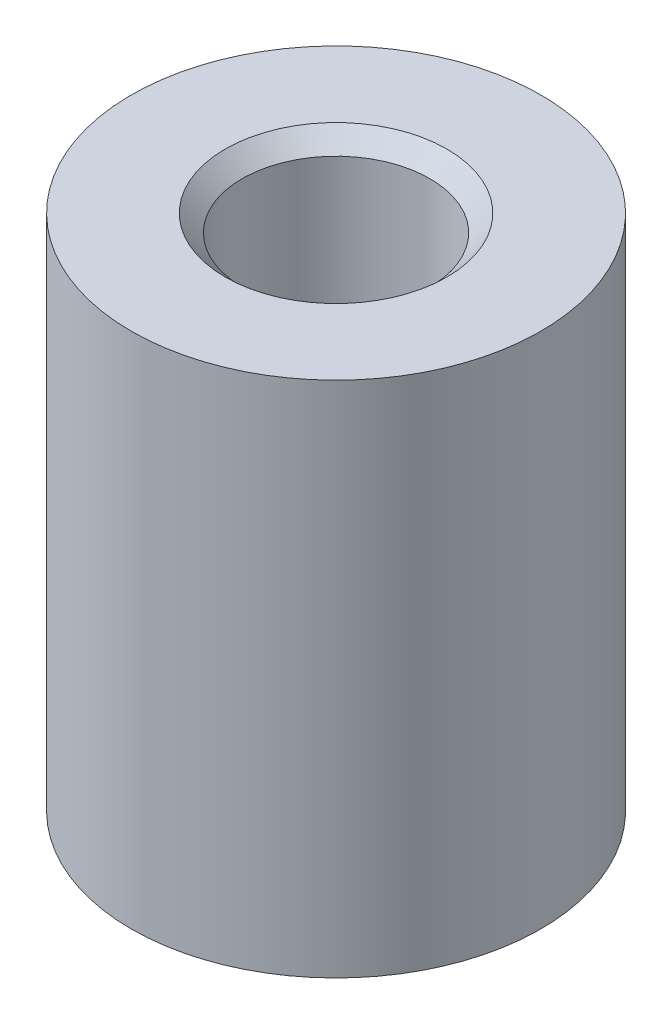
ISO-10303-21;
HEADER;
FILE_DESCRIPTION(('STEP AP214'),'2;1');
FILE_NAME('part.step','',(''),(''),'','','');
FILE_SCHEMA(('AUTOMOTIVE_DESIGN { 1 0 10303 214 1 1 1 1 }'));
ENDSEC;
DATA;
#1=APPLICATION_CONTEXT('core data for automotive mechanical design processes');
#2=APPLICATION_PROTOCOL_DEFINITION('international standard','automotive_design',2000,#1);
#3=PRODUCT_CONTEXT('',#1,'mechanical');
#4=PRODUCT('Part','Part','',(#3));
#5=PRODUCT_RELATED_PRODUCT_CATEGORY('part','',(#4));
#6=PRODUCT_DEFINITION_FORMATION('','',#4);
#7=PRODUCT_DEFINITION_CONTEXT('part definition',#1,'design');
#8=PRODUCT_DEFINITION('design','',#6,#7);
#9=PRODUCT_DEFINITION_SHAPE('','',#8);
#10=(LENGTH_UNIT() NAMED_UNIT(*) SI_UNIT(.MILLI.,.METRE.));
#11=(NAMED_UNIT(*) PLANE_ANGLE_UNIT() SI_UNIT($,.RADIAN.));
#12=(NAMED_UNIT(*) SI_UNIT($,.STERADIAN.) SOLID_ANGLE_UNIT());
#13=UNCERTAINTY_MEASURE_WITH_UNIT(LENGTH_MEASURE(1.E-05),#10,'distance_accuracy_value','');
#14=(GEOMETRIC_REPRESENTATION_CONTEXT(3) GLOBAL_UNCERTAINTY_ASSIGNED_CONTEXT((#13)) GLOBAL_UNIT_ASSIGNED_CONTEXT((#10,
#11,#12)) REPRESENTATION_CONTEXT('',''));
#15=CARTESIAN_POINT('',(0.,0.,0.));
#16=DIRECTION('',(0.,0.,1.));
#17=DIRECTION('',(1.,0.,0.));
#18=AXIS2_PLACEMENT_3D('',#15,#16,#17);
#19=CARTESIAN_POINT('',(0.,-7.587499938,0.));
#20=DIRECTION('',(0.,1.,0.));
#21=DIRECTION('',(0.,0.,1.));
#22=AXIS2_PLACEMENT_3D('',#19,#20,#21);
#23=CYLINDRICAL_SURFACE('',#22,2.749999953);
#24=CARTESIAN_POINT('',(0.,7.087499938,0.));
#25=DIRECTION('',(0.,1.,0.));
#26=DIRECTION('',(0.,0.,1.));
#27=AXIS2_PLACEMENT_3D('',#24,#25,#26);
#28=CIRCLE('',#27,2.749999953);
#29=CARTESIAN_POINT('',(0.,7.087499938,2.749999953));
#30=VERTEX_POINT('',#29);
#31=EDGE_CURVE('E48',#30,#30,#28,.T.);
#32=CARTESIAN_POINT('',(0.,-7.087499938,0.));
#33=DIRECTION('',(0.,-1.,0.));
#34=DIRECTION('',(0.,0.,-1.));
#35=AXIS2_PLACEMENT_3D('',#32,#33,#34);
#36=CIRCLE('',#35,2.749999953);
#37=CARTESIAN_POINT('',(0.,-7.087499938,2.749999953));
#38=VERTEX_POINT('',#37);
#39=EDGE_CURVE('E39',#38,#38,#36,.F.);
#40=CARTESIAN_POINT('',(0.,7.087499938,2.749999953));
#41=CARTESIAN_POINT('',(0.,6.93984368929167,2.749999953));
#42=CARTESIAN_POINT('',(0.,6.79218744058333,2.749999953));
#43=CARTESIAN_POINT('',(0.,6.49687494316667,2.749999953));
#44=CARTESIAN_POINT('',(0.,6.34921869445833,2.749999953));
#45=CARTESIAN_POINT('',(0.,6.05390619704167,2.749999953));
#46=CARTESIAN_POINT('',(0.,5.90624994833333,2.749999953));
#47=CARTESIAN_POINT('',(0.,5.61093745091667,2.749999953));
#48=CARTESIAN_POINT('',(0.,5.46328120220833,2.749999953));
#49=CARTESIAN_POINT('',(0.,5.16796870479167,2.749999953));
#50=CARTESIAN_POINT('',(0.,5.02031245608333,2.749999953));
#51=CARTESIAN_POINT('',(0.,4.72499995866667,2.749999953));
#52=CARTESIAN_POINT('',(0.,4.57734370995833,2.749999953));
#53=CARTESIAN_POINT('',(0.,4.28203121254167,2.749999953));
#54=CARTESIAN_POINT('',(0.,4.13437496383333,2.749999953));
#55=CARTESIAN_POINT('',(0.,3.83906246641667,2.749999953));
#56=CARTESIAN_POINT('',(0.,3.69140621770833,2.749999953));
#57=CARTESIAN_POINT('',(0.,3.39609372029167,2.749999953));
#58=CARTESIAN_POINT('',(0.,3.24843747158333,2.749999953));
#59=CARTESIAN_POINT('',(0.,2.95312497416667,2.749999953));
#60=CARTESIAN_POINT('',(0.,2.80546872545833,2.749999953));
#61=CARTESIAN_POINT('',(0.,2.51015622804167,2.749999953));
#62=CARTESIAN_POINT('',(0.,2.36249997933333,2.749999953));
#63=CARTESIAN_POINT('',(0.,2.06718748191667,2.749999953));
#64=CARTESIAN_POINT('',(0.,1.91953123320833,2.749999953));
#65=CARTESIAN_POINT('',(0.,1.62421873579167,2.749999953));
#66=CARTESIAN_POINT('',(0.,1.47656248708333,2.749999953));
#67=CARTESIAN_POINT('',(0.,1.18124998966667,2.749999953));
#68=CARTESIAN_POINT('',(0.,1.03359374095833,2.749999953));
#69=CARTESIAN_POINT('',(0.,0.738281243541666,2.749999953));
#70=CARTESIAN_POINT('',(0.,0.590624994833333,2.749999953));
#71=CARTESIAN_POINT('',(0.,0.295312497416667,2.749999953));
#72=CARTESIAN_POINT('',(0.,0.147656248708333,2.749999953));
#73=CARTESIAN_POINT('',(0.,-0.147656248708333,2.749999953));
#74=CARTESIAN_POINT('',(0.,-0.295312497416667,2.749999953));
#75=CARTESIAN_POINT('',(0.,-0.590624994833334,2.749999953));
#76=CARTESIAN_POINT('',(0.,-0.738281243541667,2.749999953));
#77=CARTESIAN_POINT('',(0.,-1.03359374095833,2.749999953));
#78=CARTESIAN_POINT('',(0.,-1.18124998966667,2.749999953));
#79=CARTESIAN_POINT('',(0.,-1.47656248708333,2.749999953));
#80=CARTESIAN_POINT('',(0.,-1.62421873579167,2.749999953));
#81=CARTESIAN_POINT('',(0.,-1.91953123320833,2.749999953));
#82=CARTESIAN_POINT('',(0.,-2.06718748191667,2.749999953));
#83=CARTESIAN_POINT('',(0.,-2.36249997933333,2.749999953));
#84=CARTESIAN_POINT('',(0.,-2.51015622804167,2.749999953));
#85=CARTESIAN_POINT('',(0.,-2.80546872545833,2.749999953));
#86=CARTESIAN_POINT('',(0.,-2.95312497416667,2.749999953));
#87=CARTESIAN_POINT('',(0.,-3.24843747158333,2.749999953));
#88=CARTESIAN_POINT('',(0.,-3.39609372029167,2.749999953));
#89=CARTESIAN_POINT('',(0.,-3.69140621770833,2.749999953));
#90=CARTESIAN_POINT('',(0.,-3.83906246641667,2.749999953));
#91=CARTESIAN_POINT('',(0.,-4.13437496383333,2.749999953));
#92=CARTESIAN_POINT('',(0.,-4.28203121254167,2.749999953));
#93=CARTESIAN_POINT('',(0.,-4.57734370995833,2.749999953));
#94=CARTESIAN_POINT('',(0.,-4.72499995866667,2.749999953));
#95=CARTESIAN_POINT('',(0.,-5.02031245608333,2.749999953));
#96=CARTESIAN_POINT('',(0.,-5.16796870479167,2.749999953));
#97=CARTESIAN_POINT('',(0.,-5.46328120220833,2.749999953));
#98=CARTESIAN_POINT('',(0.,-5.61093745091667,2.749999953));
#99=CARTESIAN_POINT('',(0.,-5.90624994833333,2.749999953));
#100=CARTESIAN_POINT('',(0.,-6.05390619704167,2.749999953));
#101=CARTESIAN_POINT('',(0.,-6.34921869445833,2.749999953));
#102=CARTESIAN_POINT('',(0.,-6.49687494316667,2.749999953));
#103=CARTESIAN_POINT('',(0.,-6.79218744058333,2.749999953));
#104=CARTESIAN_POINT('',(0.,-6.93984368929167,2.749999953));
#105=CARTESIAN_POINT('',(0.,-7.087499938,2.749999953));
#106=B_SPLINE_CURVE_WITH_KNOTS('',3,(#40,#41,#42,#43,#44,#45,#46,#47,#48,#49,#50,#51,#52,#53,
#54,#55,#56,#57,#58,#59,#60,#61,#62,#63,#64,#65,#66,#67,#68,#69,#70,#71,#72,#73,#74,#75,#76,#77,
#78,#79,#80,#81,#82,#83,#84,#85,#86,#87,#88,#89,#90,#91,#92,#93,#94,#95,#96,#97,#98,#99,#100,
#101,#102,#103,#104,#105),.UNSPECIFIED.,.F.,.F.,(4,2,2,2,2,2,2,2,2,2,2,2,2,2,2,2,2,2,2,2,2,2,2,
2,2,2,2,2,2,2,2,2,4),(0.,0.442968746125,0.885937492250001,1.328906238375,1.7718749845,
2.214843730625,2.65781247675,3.100781222875,3.543749969,3.986718715125,4.42968746125,
4.872656207375,5.3156249535,5.758593699625,6.20156244575,6.644531191875,7.087499938,
7.530468684125,7.97343743025,8.416406176375,8.8593749225,9.302343668625,9.74531241475,
10.188281160875,10.631249907,11.074218653125,11.51718739925,11.960156145375,12.4031248915,
12.846093637625,13.28906238375,13.732031129875,14.174999876),.UNSPECIFIED.);
#107=EDGE_CURVE('BSEAM35',#30,#38,#106,.T.);
#108=ORIENTED_EDGE('',*,*,#31,.T.);
#109=ORIENTED_EDGE('',*,*,#39,.F.);
#110=ORIENTED_EDGE('',*,*,#107,.T.);
#111=ORIENTED_EDGE('',*,*,#107,.F.);
#112=EDGE_LOOP('',(#108,#110,#109,#111));
#113=FACE_BOUND('',#112,.T.);
#114=ADVANCED_FACE('F35',(#113),#23,.F.);
#115=CARTESIAN_POINT('',(0.,-7.587499938,0.));
#116=DIRECTION('',(0.,1.,0.));
#117=DIRECTION('',(0.,0.,1.));
#118=AXIS2_PLACEMENT_3D('',#115,#116,#117);
#119=CYLINDRICAL_SURFACE('',#118,6.);
#120=CARTESIAN_POINT('',(0.,-7.587499938,0.));
#121=DIRECTION('',(0.,1.,0.));
#122=DIRECTION('',(0.,0.,1.));
#123=AXIS2_PLACEMENT_3D('',#120,#121,#122);
#124=CIRCLE('',#123,6.);
#125=CARTESIAN_POINT('',(0.,-7.587499938,6.));
#126=VERTEX_POINT('',#125);
#127=EDGE_CURVE('E10',#126,#126,#124,.T.);
#128=CARTESIAN_POINT('',(0.,7.587499938,0.));
#129=DIRECTION('',(0.,1.,0.));
#130=DIRECTION('',(0.,0.,1.));
#131=AXIS2_PLACEMENT_3D('',#128,#129,#130);
#132=CIRCLE('',#131,6.);
#133=CARTESIAN_POINT('',(0.,7.587499938,6.));
#134=VERTEX_POINT('',#133);
#135=EDGE_CURVE('E43',#134,#134,#132,.T.);
#136=CARTESIAN_POINT('',(0.,-7.587499938,6.));
#137=CARTESIAN_POINT('',(0.,-7.429427022625,6.));
#138=CARTESIAN_POINT('',(0.,-7.27135410725,6.));
#139=CARTESIAN_POINT('',(0.,-6.9552082765,6.));
#140=CARTESIAN_POINT('',(0.,-6.797135361125,6.));
#141=CARTESIAN_POINT('',(0.,-6.480989530375,6.));
#142=CARTESIAN_POINT('',(0.,-6.322916615,6.));
#143=CARTESIAN_POINT('',(0.,-6.00677078425,6.));
#144=CARTESIAN_POINT('',(0.,-5.848697868875,6.));
#145=CARTESIAN_POINT('',(0.,-5.532552038125,6.));
#146=CARTESIAN_POINT('',(0.,-5.37447912275,6.));
#147=CARTESIAN_POINT('',(0.,-5.058333292,6.));
#148=CARTESIAN_POINT('',(0.,-4.900260376625,6.));
#149=CARTESIAN_POINT('',(0.,-4.584114545875,6.));
#150=CARTESIAN_POINT('',(0.,-4.4260416305,6.));
#151=CARTESIAN_POINT('',(0.,-4.10989579975,6.));
#152=CARTESIAN_POINT('',(0.,-3.951822884375,6.));
#153=CARTESIAN_POINT('',(0.,-3.635677053625,6.));
#154=CARTESIAN_POINT('',(0.,-3.47760413825,6.));
#155=CARTESIAN_POINT('',(0.,-3.1614583075,6.));
#156=CARTESIAN_POINT('',(0.,-3.003385392125,6.));
#157=CARTESIAN_POINT('',(0.,-2.687239561375,6.));
#158=CARTESIAN_POINT('',(0.,-2.529166646,6.));
#159=CARTESIAN_POINT('',(0.,-2.21302081525,6.));
#160=CARTESIAN_POINT('',(0.,-2.054947899875,6.));
#161=CARTESIAN_POINT('',(0.,-1.738802069125,6.));
#162=CARTESIAN_POINT('',(0.,-1.58072915375,6.));
#163=CARTESIAN_POINT('',(0.,-1.264583323,6.));
#164=CARTESIAN_POINT('',(0.,-1.106510407625,6.));
#165=CARTESIAN_POINT('',(0.,-0.790364576875001,6.));
#166=CARTESIAN_POINT('',(0.,-0.632291661500001,6.));
#167=CARTESIAN_POINT('',(0.,-0.316145830750001,6.));
#168=CARTESIAN_POINT('',(0.,-0.158072915375001,6.));
#169=CARTESIAN_POINT('',(0.,0.158072915374999,6.));
#170=CARTESIAN_POINT('',(0.,0.316145830749999,6.));
#171=CARTESIAN_POINT('',(0.,0.632291661499998,6.));
#172=CARTESIAN_POINT('',(0.,0.790364576874998,6.));
#173=CARTESIAN_POINT('',(0.,1.106510407625,6.));
#174=CARTESIAN_POINT('',(0.,1.264583323,6.));
#175=CARTESIAN_POINT('',(0.,1.58072915375,6.));
#176=CARTESIAN_POINT('',(0.,1.738802069125,6.));
#177=CARTESIAN_POINT('',(0.,2.054947899875,6.));
#178=CARTESIAN_POINT('',(0.,2.21302081525,6.));
#179=CARTESIAN_POINT('',(0.,2.529166646,6.));
#180=CARTESIAN_POINT('',(0.,2.687239561375,6.));
#181=CARTESIAN_POINT('',(0.,3.003385392125,6.));
#182=CARTESIAN_POINT('',(0.,3.1614583075,6.));
#183=CARTESIAN_POINT('',(0.,3.47760413825,6.));
#184=CARTESIAN_POINT('',(0.,3.635677053625,6.));
#185=CARTESIAN_POINT('',(0.,3.951822884375,6.));
#186=CARTESIAN_POINT('',(0.,4.10989579975,6.));
#187=CARTESIAN_POINT('',(0.,4.4260416305,6.));
#188=CARTESIAN_POINT('',(0.,4.584114545875,6.));
#189=CARTESIAN_POINT('',(0.,4.900260376625,6.));
#190=CARTESIAN_POINT('',(0.,5.058333292,6.));
#191=CARTESIAN_POINT('',(0.,5.37447912275,6.));
#192=CARTESIAN_POINT('',(0.,5.532552038125,6.));
#193=CARTESIAN_POINT('',(0.,5.848697868875,6.));
#194=CARTESIAN_POINT('',(0.,6.00677078425,6.));
#195=CARTESIAN_POINT('',(0.,6.322916615,6.));
#196=CARTESIAN_POINT('',(0.,6.480989530375,6.));
#197=CARTESIAN_POINT('',(0.,6.797135361125,6.));
#198=CARTESIAN_POINT('',(0.,6.9552082765,6.));
#199=CARTESIAN_POINT('',(0.,7.27135410725,6.));
#200=CARTESIAN_POINT('',(0.,7.429427022625,6.));
#201=CARTESIAN_POINT('',(0.,7.587499938,6.));
#202=B_SPLINE_CURVE_WITH_KNOTS('',3,(#136,#137,#138,#139,#140,#141,#142,#143,#144,#145,#146,
#147,#148,#149,#150,#151,#152,#153,#154,#155,#156,#157,#158,#159,#160,#161,#162,#163,#164,#165,
#166,#167,#168,#169,#170,#171,#172,#173,#174,#175,#176,#177,#178,#179,#180,#181,#182,#183,#184,
#185,#186,#187,#188,#189,#190,#191,#192,#193,#194,#195,#196,#197,#198,#199,#200,#201),
.UNSPECIFIED.,.F.,.F.,(4,2,2,2,2,2,2,2,2,2,2,2,2,2,2,2,2,2,2,2,2,2,2,2,2,2,2,2,2,2,2,2,4),(0.,
0.474218746125,0.948437492249999,1.422656238375,1.8968749845,2.371093730625,2.84531247675,
3.319531222875,3.793749969,4.267968715125,4.74218746125,5.216406207375,5.6906249535,
6.164843699625,6.63906244575,7.113281191875,7.587499938,8.061718684125,8.53593743025,
9.010156176375,9.4843749225,9.958593668625,10.43281241475,10.907031160875,11.381249907,
11.855468653125,12.32968739925,12.803906145375,13.2781248915,13.752343637625,14.22656238375,
14.700781129875,15.174999876),.UNSPECIFIED.);
#203=EDGE_CURVE('BSEAM37',#126,#134,#202,.T.);
#204=ORIENTED_EDGE('',*,*,#127,.T.);
#205=ORIENTED_EDGE('',*,*,#135,.F.);
#206=ORIENTED_EDGE('',*,*,#203,.T.);
#207=ORIENTED_EDGE('',*,*,#203,.F.);
#208=EDGE_LOOP('',(#204,#206,#205,#207));
#209=FACE_BOUND('',#208,.T.);
#210=ADVANCED_FACE('F37',(#209),#119,.T.);
#211=CARTESIAN_POINT('',(0.,-7.587499938,0.));
#212=DIRECTION('',(0.,1.,0.));
#213=DIRECTION('',(0.,0.,1.));
#214=AXIS2_PLACEMENT_3D('',#211,#212,#213);
#215=PLANE('',#214);
#216=CARTESIAN_POINT('',(0.,-7.587499938,0.));
#217=DIRECTION('',(0.,1.,0.));
#218=DIRECTION('',(0.,0.,1.));
#219=AXIS2_PLACEMENT_3D('',#216,#217,#218);
#220=CIRCLE('',#219,3.249999953);
#221=CARTESIAN_POINT('',(0.,-7.587499938,3.249999953));
#222=VERTEX_POINT('',#221);
#223=EDGE_CURVE('E59',#222,#222,#220,.T.);
#224=ORIENTED_EDGE('',*,*,#223,.T.);
#225=EDGE_LOOP('',(#224));
#226=FACE_BOUND('',#225,.T.);
#227=ORIENTED_EDGE('',*,*,#127,.F.);
#228=EDGE_LOOP('',(#227));
#229=FACE_BOUND('',#228,.T.);
#230=ADVANCED_FACE('F64',(#226,#229),#215,.F.);
#231=CARTESIAN_POINT('',(0.,7.587499938,0.));
#232=DIRECTION('',(0.,1.,0.));
#233=DIRECTION('',(0.,0.,1.));
#234=AXIS2_PLACEMENT_3D('',#231,#232,#233);
#235=PLANE('',#234);
#236=CARTESIAN_POINT('',(0.,7.587499938,0.));
#237=DIRECTION('',(0.,1.,0.));
#238=DIRECTION('',(0.,0.,1.));
#239=AXIS2_PLACEMENT_3D('',#236,#237,#238);
#240=CIRCLE('',#239,3.249999953);
#241=CARTESIAN_POINT('',(0.,7.587499938,3.249999953));
#242=VERTEX_POINT('',#241);
#243=EDGE_CURVE('E52',#242,#242,#240,.T.);
#244=ORIENTED_EDGE('',*,*,#243,.F.);
#245=EDGE_LOOP('',(#244));
#246=FACE_BOUND('',#245,.T.);
#247=ORIENTED_EDGE('',*,*,#135,.T.);
#248=EDGE_LOOP('',(#247));
#249=FACE_BOUND('',#248,.T.);
#250=ADVANCED_FACE('F81',(#246,#249),#235,.T.);
#251=CARTESIAN_POINT('',(0.,7.587499938,0.));
#252=DIRECTION('',(0.,1.,0.));
#253=DIRECTION('',(0.,0.,1.));
#254=AXIS2_PLACEMENT_3D('',#251,#252,#253);
#255=CONICAL_SURFACE('',#254,3.249999953,0.78539816339745);
#256=ORIENTED_EDGE('',*,*,#243,.T.);
#257=EDGE_LOOP('',(#256));
#258=FACE_BOUND('',#257,.T.);
#259=ORIENTED_EDGE('',*,*,#31,.F.);
#260=EDGE_LOOP('',(#259));
#261=FACE_BOUND('',#260,.T.);
#262=ADVANCED_FACE('F70',(#258,#261),#255,.F.);
#263=CARTESIAN_POINT('',(0.,-7.587499938,0.));
#264=DIRECTION('',(0.,-1.,0.));
#265=DIRECTION('',(0.,0.,1.));
#266=AXIS2_PLACEMENT_3D('',#263,#264,#265);
#267=CONICAL_SURFACE('',#266,3.249999953,0.78539816339745);
#268=ORIENTED_EDGE('',*,*,#223,.F.);
#269=EDGE_LOOP('',(#268));
#270=FACE_BOUND('',#269,.T.);
#271=ORIENTED_EDGE('',*,*,#39,.T.);
#272=EDGE_LOOP('',(#271));
#273=FACE_BOUND('',#272,.T.);
#274=ADVANCED_FACE('F67',(#270,#273),#267,.F.);
#275=CLOSED_SHELL('',(#114,#210,#230,#250,#262,#274));
#276=MANIFOLD_SOLID_BREP('B2',#275);
#277=ADVANCED_BREP_SHAPE_REPRESENTATION('',(#18,#276),#14);
#278=SHAPE_DEFINITION_REPRESENTATION(#9,#277);
ENDSEC;
END-ISO-10303-21;
